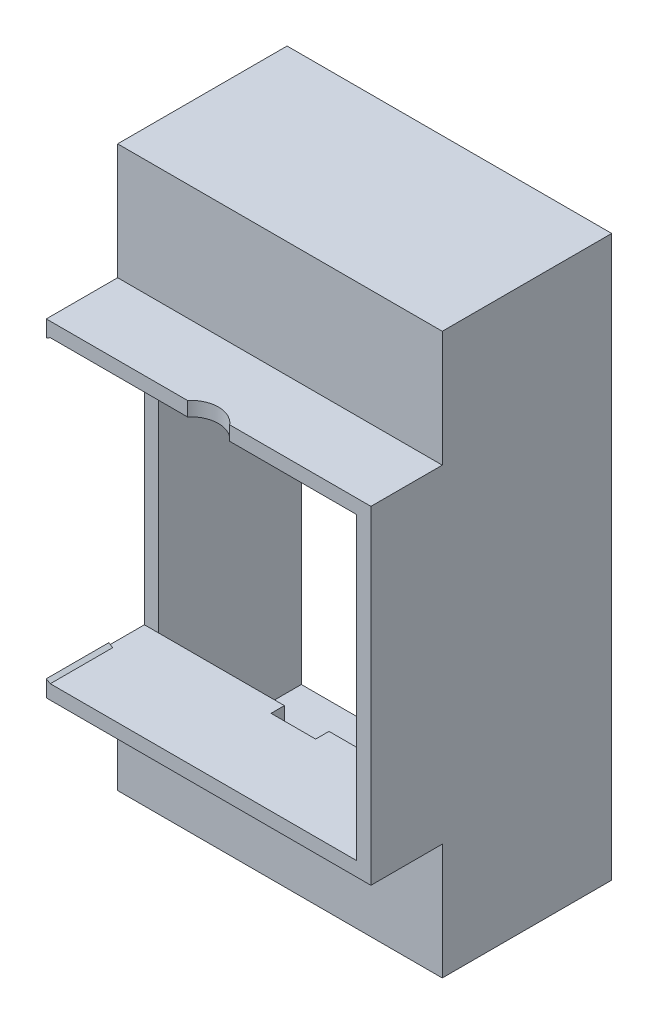
ISO-10303-21;
HEADER;
FILE_DESCRIPTION(('STEP AP214'),'2;1');
FILE_NAME('part.step','',(''),(''),'','','');
FILE_SCHEMA(('AUTOMOTIVE_DESIGN { 1 0 10303 214 1 1 1 1 }'));
ENDSEC;
DATA;
#1=APPLICATION_CONTEXT('core data for automotive mechanical design processes');
#2=APPLICATION_PROTOCOL_DEFINITION('international standard','automotive_design',2000,#1);
#3=PRODUCT_CONTEXT('',#1,'mechanical');
#4=PRODUCT('Part','Part','',(#3));
#5=PRODUCT_RELATED_PRODUCT_CATEGORY('part','',(#4));
#6=PRODUCT_DEFINITION_FORMATION('','',#4);
#7=PRODUCT_DEFINITION_CONTEXT('part definition',#1,'design');
#8=PRODUCT_DEFINITION('design','',#6,#7);
#9=PRODUCT_DEFINITION_SHAPE('','',#8);
#10=(LENGTH_UNIT() NAMED_UNIT(*) SI_UNIT(.MILLI.,.METRE.));
#11=(NAMED_UNIT(*) PLANE_ANGLE_UNIT() SI_UNIT($,.RADIAN.));
#12=(NAMED_UNIT(*) SI_UNIT($,.STERADIAN.) SOLID_ANGLE_UNIT());
#13=UNCERTAINTY_MEASURE_WITH_UNIT(LENGTH_MEASURE(1.E-05),#10,'distance_accuracy_value','');
#14=(GEOMETRIC_REPRESENTATION_CONTEXT(3) GLOBAL_UNCERTAINTY_ASSIGNED_CONTEXT((#13)) GLOBAL_UNIT_ASSIGNED_CONTEXT((#10,
#11,#12)) REPRESENTATION_CONTEXT('',''));
#15=CARTESIAN_POINT('',(0.,0.,0.));
#16=DIRECTION('',(0.,0.,1.));
#17=DIRECTION('',(1.,0.,0.));
#18=AXIS2_PLACEMENT_3D('',#15,#16,#17);
#19=CARTESIAN_POINT('',(30.25,31.4,-8.));
#20=DIRECTION('',(-1.,0.,0.));
#21=DIRECTION('',(0.,0.,1.));
#22=AXIS2_PLACEMENT_3D('',#19,#20,#21);
#23=PLANE('',#22);
#24=DIRECTION('',(0.,0.,-1.));
#25=VECTOR('',#24,1.);
#26=CARTESIAN_POINT('',(30.25,16.8,7.));
#27=LINE('',#26,#25);
#28=CARTESIAN_POINT('',(30.25,16.8,12.));
#29=VERTEX_POINT('',#28);
#30=CARTESIAN_POINT('',(30.25,16.8,8.));
#31=VERTEX_POINT('',#30);
#32=EDGE_CURVE('E116',#29,#31,#27,.T.);
#33=ORIENTED_EDGE('',*,*,#32,.F.);
#34=DIRECTION('',(0.,1.,0.));
#35=VECTOR('',#34,1.);
#36=CARTESIAN_POINT('',(30.25,0.,12.));
#37=LINE('',#36,#35);
#38=CARTESIAN_POINT('',(30.25,16.541085212282,12.));
#39=VERTEX_POINT('',#38);
#40=EDGE_CURVE('E119',#39,#29,#37,.T.);
#41=ORIENTED_EDGE('',*,*,#40,.F.);
#42=DIRECTION('',(0.,0.,-1.));
#43=VECTOR('',#42,1.);
#44=CARTESIAN_POINT('',(30.25,16.541085212282,12.));
#45=LINE('',#44,#43);
#46=CARTESIAN_POINT('',(30.25,16.541085212282,19.));
#47=VERTEX_POINT('',#46);
#48=EDGE_CURVE('E110',#47,#39,#45,.T.);
#49=ORIENTED_EDGE('',*,*,#48,.F.);
#50=DIRECTION('',(0.,1.,0.));
#51=VECTOR('',#50,1.);
#52=CARTESIAN_POINT('',(30.25,-10.9844410203712,19.));
#53=LINE('',#52,#51);
#54=CARTESIAN_POINT('',(30.25,18.4,19.));
#55=VERTEX_POINT('',#54);
#56=EDGE_CURVE('E129',#47,#55,#53,.T.);
#57=ORIENTED_EDGE('',*,*,#56,.T.);
#58=DIRECTION('',(0.,0.,1.));
#59=VECTOR('',#58,1.);
#60=CARTESIAN_POINT('',(30.25,18.4,7.));
#61=LINE('',#60,#59);
#62=CARTESIAN_POINT('',(30.25,18.4,11.));
#63=VERTEX_POINT('',#62);
#64=EDGE_CURVE('E113',#63,#55,#61,.T.);
#65=ORIENTED_EDGE('',*,*,#64,.F.);
#66=DIRECTION('',(0.,1.,0.));
#67=VECTOR('',#66,1.);
#68=CARTESIAN_POINT('',(30.25,18.4,11.));
#69=LINE('',#68,#67);
#70=CARTESIAN_POINT('',(30.25,31.4,11.));
#71=VERTEX_POINT('',#70);
#72=EDGE_CURVE('E210',#63,#71,#69,.T.);
#73=ORIENTED_EDGE('',*,*,#72,.T.);
#74=DIRECTION('',(0.,0.,-1.));
#75=VECTOR('',#74,1.);
#76=CARTESIAN_POINT('',(30.25,31.4,11.));
#77=LINE('',#76,#75);
#78=CARTESIAN_POINT('',(30.25,31.4,-8.));
#79=VERTEX_POINT('',#78);
#80=EDGE_CURVE('E195',#71,#79,#77,.T.);
#81=ORIENTED_EDGE('',*,*,#80,.T.);
#82=DIRECTION('',(0.,1.,0.));
#83=VECTOR('',#82,1.);
#84=CARTESIAN_POINT('',(30.25,31.4,-8.));
#85=LINE('',#84,#83);
#86=CARTESIAN_POINT('',(30.2499999999999,-31.4,-8.));
#87=VERTEX_POINT('',#86);
#88=EDGE_CURVE('E242',#87,#79,#85,.T.);
#89=ORIENTED_EDGE('',*,*,#88,.F.);
#90=DIRECTION('',(0.,0.,-1.));
#91=VECTOR('',#90,1.);
#92=CARTESIAN_POINT('',(30.2499999999999,-31.4,11.));
#93=LINE('',#92,#91);
#94=CARTESIAN_POINT('',(30.2499999999999,-31.4,11.));
#95=VERTEX_POINT('',#94);
#96=EDGE_CURVE('E213',#95,#87,#93,.T.);
#97=ORIENTED_EDGE('',*,*,#96,.F.);
#98=DIRECTION('',(0.,1.,0.));
#99=VECTOR('',#98,1.);
#100=CARTESIAN_POINT('',(30.2499999999999,-18.4,11.));
#101=LINE('',#100,#99);
#102=CARTESIAN_POINT('',(30.2499999999999,-18.4,11.));
#103=VERTEX_POINT('',#102);
#104=EDGE_CURVE('E228',#95,#103,#101,.T.);
#105=ORIENTED_EDGE('',*,*,#104,.T.);
#106=DIRECTION('',(0.,0.,-1.));
#107=VECTOR('',#106,1.);
#108=CARTESIAN_POINT('',(30.25,-18.4,7.));
#109=LINE('',#108,#107);
#110=CARTESIAN_POINT('',(30.25,-18.4,19.));
#111=VERTEX_POINT('',#110);
#112=EDGE_CURVE('E106',#111,#103,#109,.T.);
#113=ORIENTED_EDGE('',*,*,#112,.F.);
#114=CARTESIAN_POINT('',(30.25,-16.5410852122849,19.));
#115=VERTEX_POINT('',#114);
#116=EDGE_CURVE('E128',#111,#115,#53,.T.);
#117=ORIENTED_EDGE('',*,*,#116,.T.);
#118=DIRECTION('',(0.,0.,-1.));
#119=VECTOR('',#118,1.);
#120=CARTESIAN_POINT('',(30.25,-16.5410852122849,12.));
#121=LINE('',#120,#119);
#122=CARTESIAN_POINT('',(30.25,-16.5410852122849,12.));
#123=VERTEX_POINT('',#122);
#124=EDGE_CURVE('E132',#115,#123,#121,.T.);
#125=ORIENTED_EDGE('',*,*,#124,.T.);
#126=DIRECTION('',(0.,1.,0.));
#127=VECTOR('',#126,1.);
#128=CARTESIAN_POINT('',(30.25,0.,12.));
#129=LINE('',#128,#127);
#130=CARTESIAN_POINT('',(30.25,-16.8,12.));
#131=VERTEX_POINT('',#130);
#132=EDGE_CURVE('E125',#131,#123,#129,.T.);
#133=ORIENTED_EDGE('',*,*,#132,.F.);
#134=DIRECTION('',(0.,0.,1.));
#135=VECTOR('',#134,1.);
#136=CARTESIAN_POINT('',(30.25,-16.8,7.));
#137=LINE('',#136,#135);
#138=CARTESIAN_POINT('',(30.2499999999999,-16.7999999999999,8.));
#139=VERTEX_POINT('',#138);
#140=EDGE_CURVE('E122',#139,#131,#137,.T.);
#141=ORIENTED_EDGE('',*,*,#140,.F.);
#142=DIRECTION('',(0.,1.,0.));
#143=VECTOR('',#142,1.);
#144=CARTESIAN_POINT('',(30.25,31.4,8.));
#145=LINE('',#144,#143);
#146=EDGE_CURVE('E235',#139,#31,#145,.T.);
#147=ORIENTED_EDGE('',*,*,#146,.T.);
#148=EDGE_LOOP('',(#33,#41,#49,#57,#65,#73,#81,#89,#97,#105,#113,#117,#125,#133,#141,#147));
#149=FACE_BOUND('',#148,.T.);
#150=ADVANCED_FACE('F35',(#149),#23,.T.);
#151=CARTESIAN_POINT('',(27.25,-10.9844410203712,19.));
#152=DIRECTION('',(0.,0.,-1.));
#153=DIRECTION('',(-1.,0.,0.));
#154=AXIS2_PLACEMENT_3D('',#151,#152,#153);
#155=PLANE('',#154);
#156=ORIENTED_EDGE('',*,*,#116,.F.);
#157=DIRECTION('',(1.,0.,0.));
#158=VECTOR('',#157,1.);
#159=CARTESIAN_POINT('',(59.8500000000001,-18.4,19.));
#160=LINE('',#159,#158);
#161=CARTESIAN_POINT('',(66.6500000000001,-18.4,19.));
#162=VERTEX_POINT('',#161);
#163=EDGE_CURVE('E137',#111,#162,#160,.T.);
#164=ORIENTED_EDGE('',*,*,#163,.T.);
#165=DIRECTION('',(0.,1.,0.));
#166=VECTOR('',#165,1.);
#167=CARTESIAN_POINT('',(66.65,16.9,19.));
#168=LINE('',#167,#166);
#169=CARTESIAN_POINT('',(66.65,18.4,19.));
#170=VERTEX_POINT('',#169);
#171=EDGE_CURVE('E151',#162,#170,#168,.T.);
#172=ORIENTED_EDGE('',*,*,#171,.T.);
#173=DIRECTION('',(-1.,0.,0.));
#174=VECTOR('',#173,1.);
#175=CARTESIAN_POINT('',(29.75,18.4,19.));
#176=LINE('',#175,#174);
#177=CARTESIAN_POINT('',(50.8185438564654,18.4,19.));
#178=VERTEX_POINT('',#177);
#179=EDGE_CURVE('E143',#170,#178,#176,.T.);
#180=ORIENTED_EDGE('',*,*,#179,.T.);
#181=DIRECTION('',(0.,1.,0.));
#182=VECTOR('',#181,1.);
#183=CARTESIAN_POINT('',(50.8185438564654,-27.101,19.));
#184=LINE('',#183,#182);
#185=CARTESIAN_POINT('',(50.8185438564654,16.8,19.));
#186=VERTEX_POINT('',#185);
#187=EDGE_CURVE('E497',#186,#178,#184,.T.);
#188=ORIENTED_EDGE('',*,*,#187,.F.);
#189=DIRECTION('',(1.,0.,0.));
#190=VECTOR('',#189,1.);
#191=CARTESIAN_POINT('',(29.75,16.8,19.));
#192=LINE('',#191,#190);
#193=CARTESIAN_POINT('',(65.05,16.8,19.));
#194=VERTEX_POINT('',#193);
#195=EDGE_CURVE('E144',#186,#194,#192,.T.);
#196=ORIENTED_EDGE('',*,*,#195,.T.);
#197=DIRECTION('',(0.,-1.,0.));
#198=VECTOR('',#197,1.);
#199=CARTESIAN_POINT('',(65.05,15.3,19.));
#200=LINE('',#199,#198);
#201=CARTESIAN_POINT('',(65.0500000000001,-16.8,19.));
#202=VERTEX_POINT('',#201);
#203=EDGE_CURVE('E458',#194,#202,#200,.T.);
#204=ORIENTED_EDGE('',*,*,#203,.T.);
#205=DIRECTION('',(-1.,0.,0.));
#206=VECTOR('',#205,1.);
#207=CARTESIAN_POINT('',(29.75,-16.8,19.));
#208=LINE('',#207,#206);
#209=CARTESIAN_POINT('',(30.6984535671534,-16.8,19.));
#210=VERTEX_POINT('',#209);
#211=EDGE_CURVE('E148',#202,#210,#208,.T.);
#212=ORIENTED_EDGE('',*,*,#211,.T.);
#213=DIRECTION('',(0.866025403784439,-0.5,0.));
#214=VECTOR('',#213,1.);
#215=CARTESIAN_POINT('',(0.399999999999078,0.692820323025954,19.));
#216=LINE('',#215,#214);
#217=EDGE_CURVE('E152',#115,#210,#216,.T.);
#218=ORIENTED_EDGE('',*,*,#217,.F.);
#219=EDGE_LOOP('',(#156,#164,#172,#180,#188,#196,#204,#212,#218));
#220=FACE_BOUND('',#219,.T.);
#221=ADVANCED_FACE('F490',(#220),#155,.F.);
#222=ORIENTED_EDGE('',*,*,#56,.F.);
#223=DIRECTION('',(0.866025403784439,0.499999999999999,0.));
#224=VECTOR('',#223,1.);
#225=CARTESIAN_POINT('',(19.1061487217433,10.1071796769714,19.));
#226=LINE('',#225,#224);
#227=CARTESIAN_POINT('',(30.6984535671584,16.8,19.));
#228=VERTEX_POINT('',#227);
#229=EDGE_CURVE('E109',#47,#228,#226,.T.);
#230=ORIENTED_EDGE('',*,*,#229,.T.);
#231=CARTESIAN_POINT('',(46.0814561435346,16.8,19.));
#232=VERTEX_POINT('',#231);
#233=EDGE_CURVE('E147',#228,#232,#192,.T.);
#234=ORIENTED_EDGE('',*,*,#233,.T.);
#235=DIRECTION('',(0.,1.,0.));
#236=VECTOR('',#235,1.);
#237=CARTESIAN_POINT('',(46.0814561435346,-27.101,19.));
#238=LINE('',#237,#236);
#239=CARTESIAN_POINT('',(46.0814561435346,18.4,19.));
#240=VERTEX_POINT('',#239);
#241=EDGE_CURVE('E493',#240,#232,#238,.F.);
#242=ORIENTED_EDGE('',*,*,#241,.F.);
#243=EDGE_CURVE('E140',#240,#55,#176,.T.);
#244=ORIENTED_EDGE('',*,*,#243,.T.);
#245=EDGE_LOOP('',(#222,#230,#234,#242,#244));
#246=FACE_BOUND('',#245,.T.);
#247=ADVANCED_FACE('F509',(#246),#155,.F.);
#248=CARTESIAN_POINT('',(0.,0.,12.));
#249=DIRECTION('',(0.,0.,-1.));
#250=DIRECTION('',(-1.,0.,0.));
#251=AXIS2_PLACEMENT_3D('',#248,#249,#250);
#252=PLANE('',#251);
#253=DIRECTION('',(-1.,0.,0.));
#254=VECTOR('',#253,1.);
#255=CARTESIAN_POINT('',(29.75,-16.8,12.));
#256=LINE('',#255,#254);
#257=CARTESIAN_POINT('',(30.6984535671534,-16.8,12.));
#258=VERTEX_POINT('',#257);
#259=EDGE_CURVE('E164',#258,#131,#256,.T.);
#260=ORIENTED_EDGE('',*,*,#259,.T.);
#261=ORIENTED_EDGE('',*,*,#132,.T.);
#262=DIRECTION('',(-0.866025403784439,0.5,0.));
#263=VECTOR('',#262,1.);
#264=CARTESIAN_POINT('',(19.106148721742,-10.1071796769735,12.));
#265=LINE('',#264,#263);
#266=EDGE_CURVE('E39',#258,#123,#265,.T.);
#267=ORIENTED_EDGE('',*,*,#266,.F.);
#268=EDGE_LOOP('',(#260,#261,#267));
#269=FACE_BOUND('',#268,.T.);
#270=ADVANCED_FACE('F566',(#269),#252,.T.);
#271=CARTESIAN_POINT('',(29.75,-16.8,7.));
#272=DIRECTION('',(0.,1.,0.));
#273=DIRECTION('',(-1.,0.,0.));
#274=AXIS2_PLACEMENT_3D('',#271,#272,#273);
#275=PLANE('',#274);
#276=DIRECTION('',(-1.,0.,0.));
#277=VECTOR('',#276,1.);
#278=CARTESIAN_POINT('',(29.75,-16.8,8.));
#279=LINE('',#278,#277);
#280=CARTESIAN_POINT('',(31.8499999999999,-16.8,8.));
#281=VERTEX_POINT('',#280);
#282=EDGE_CURVE('E231',#281,#139,#279,.T.);
#283=ORIENTED_EDGE('',*,*,#282,.T.);
#284=ORIENTED_EDGE('',*,*,#140,.T.);
#285=ORIENTED_EDGE('',*,*,#259,.F.);
#286=DIRECTION('',(0.,0.,1.));
#287=VECTOR('',#286,1.);
#288=CARTESIAN_POINT('',(30.6984535671534,-16.8,7.));
#289=LINE('',#288,#287);
#290=EDGE_CURVE('E163',#258,#210,#289,.T.);
#291=ORIENTED_EDGE('',*,*,#290,.T.);
#292=ORIENTED_EDGE('',*,*,#211,.F.);
#293=DIRECTION('',(0.,0.,1.));
#294=VECTOR('',#293,1.);
#295=CARTESIAN_POINT('',(65.0500000000001,-16.8,7.));
#296=LINE('',#295,#294);
#297=CARTESIAN_POINT('',(65.0500000000001,-16.8,8.));
#298=VERTEX_POINT('',#297);
#299=EDGE_CURVE('E455',#298,#202,#296,.T.);
#300=ORIENTED_EDGE('',*,*,#299,.F.);
#301=DIRECTION('',(-1.,0.,0.));
#302=VECTOR('',#301,1.);
#303=CARTESIAN_POINT('',(29.75,-16.8,8.));
#304=LINE('',#303,#302);
#305=CARTESIAN_POINT('',(50.95,-16.8,8.));
#306=VERTEX_POINT('',#305);
#307=EDGE_CURVE('E186',#298,#306,#304,.T.);
#308=ORIENTED_EDGE('',*,*,#307,.T.);
#309=DIRECTION('',(0.,0.,-1.));
#310=VECTOR('',#309,1.);
#311=CARTESIAN_POINT('',(50.95,-16.7999999999999,7.));
#312=LINE('',#311,#310);
#313=CARTESIAN_POINT('',(50.95,-16.7999999999999,9.5));
#314=VERTEX_POINT('',#313);
#315=EDGE_CURVE('E290',#314,#306,#312,.T.);
#316=ORIENTED_EDGE('',*,*,#315,.F.);
#317=DIRECTION('',(-1.,0.,0.));
#318=VECTOR('',#317,1.);
#319=CARTESIAN_POINT('',(29.75,-16.8,9.5));
#320=LINE('',#319,#318);
#321=CARTESIAN_POINT('',(45.95,-16.7999999999999,9.5));
#322=VERTEX_POINT('',#321);
#323=EDGE_CURVE('E82',#314,#322,#320,.T.);
#324=ORIENTED_EDGE('',*,*,#323,.T.);
#325=DIRECTION('',(0.,0.,1.));
#326=VECTOR('',#325,1.);
#327=CARTESIAN_POINT('',(45.95,-16.7999999999999,7.));
#328=LINE('',#327,#326);
#329=CARTESIAN_POINT('',(45.95,-16.8,8.));
#330=VERTEX_POINT('',#329);
#331=EDGE_CURVE('E295',#330,#322,#328,.T.);
#332=ORIENTED_EDGE('',*,*,#331,.F.);
#333=EDGE_CURVE('E189',#330,#281,#304,.T.);
#334=ORIENTED_EDGE('',*,*,#333,.T.);
#335=EDGE_LOOP('',(#283,#284,#285,#291,#292,#300,#308,#316,#324,#332,#334));
#336=FACE_BOUND('',#335,.T.);
#337=ADVANCED_FACE('F37',(#336),#275,.T.);
#338=CARTESIAN_POINT('',(19.106148721742,-10.1071796769735,12.));
#339=DIRECTION('',(-0.5,-0.866025403784439,0.));
#340=DIRECTION('',(0.866025403784439,-0.5,0.));
#341=AXIS2_PLACEMENT_3D('',#338,#339,#340);
#342=PLANE('',#341);
#343=ORIENTED_EDGE('',*,*,#124,.F.);
#344=ORIENTED_EDGE('',*,*,#217,.T.);
#345=ORIENTED_EDGE('',*,*,#290,.F.);
#346=ORIENTED_EDGE('',*,*,#266,.T.);
#347=EDGE_LOOP('',(#343,#344,#345,#346));
#348=FACE_BOUND('',#347,.T.);
#349=ADVANCED_FACE('F568',(#348),#342,.F.);
#350=DIRECTION('',(0.866025403784439,0.499999999999999,0.));
#351=VECTOR('',#350,1.);
#352=CARTESIAN_POINT('',(19.1061487217433,10.1071796769714,12.));
#353=LINE('',#352,#351);
#354=CARTESIAN_POINT('',(30.6984535671584,16.8,12.));
#355=VERTEX_POINT('',#354);
#356=EDGE_CURVE('E160',#39,#355,#353,.T.);
#357=ORIENTED_EDGE('',*,*,#356,.F.);
#358=ORIENTED_EDGE('',*,*,#40,.T.);
#359=DIRECTION('',(1.,0.,0.));
#360=VECTOR('',#359,1.);
#361=CARTESIAN_POINT('',(29.75,16.8,12.));
#362=LINE('',#361,#360);
#363=EDGE_CURVE('E157',#29,#355,#362,.T.);
#364=ORIENTED_EDGE('',*,*,#363,.T.);
#365=EDGE_LOOP('',(#357,#358,#364));
#366=FACE_BOUND('',#365,.T.);
#367=ADVANCED_FACE('F570',(#366),#252,.T.);
#368=CARTESIAN_POINT('',(29.75,16.8,7.));
#369=DIRECTION('',(0.,-1.,0.));
#370=DIRECTION('',(1.,0.,0.));
#371=AXIS2_PLACEMENT_3D('',#368,#369,#370);
#372=PLANE('',#371);
#373=ORIENTED_EDGE('',*,*,#363,.F.);
#374=ORIENTED_EDGE('',*,*,#32,.T.);
#375=DIRECTION('',(1.,0.,0.));
#376=VECTOR('',#375,1.);
#377=CARTESIAN_POINT('',(29.75,16.8,8.));
#378=LINE('',#377,#376);
#379=CARTESIAN_POINT('',(31.8499999999999,16.8,8.));
#380=VERTEX_POINT('',#379);
#381=EDGE_CURVE('E190',#31,#380,#378,.T.);
#382=ORIENTED_EDGE('',*,*,#381,.T.);
#383=CARTESIAN_POINT('',(45.95,16.8,8.));
#384=VERTEX_POINT('',#383);
#385=EDGE_CURVE('E193',#380,#384,#378,.T.);
#386=ORIENTED_EDGE('',*,*,#385,.T.);
#387=DIRECTION('',(0.,0.,-1.));
#388=VECTOR('',#387,1.);
#389=CARTESIAN_POINT('',(45.95,16.8,7.));
#390=LINE('',#389,#388);
#391=CARTESIAN_POINT('',(45.95,16.8,9.5));
#392=VERTEX_POINT('',#391);
#393=EDGE_CURVE('E298',#392,#384,#390,.T.);
#394=ORIENTED_EDGE('',*,*,#393,.F.);
#395=DIRECTION('',(1.,0.,0.));
#396=VECTOR('',#395,1.);
#397=CARTESIAN_POINT('',(29.75,16.8,9.5));
#398=LINE('',#397,#396);
#399=CARTESIAN_POINT('',(50.95,16.8,9.5));
#400=VERTEX_POINT('',#399);
#401=EDGE_CURVE('E156',#392,#400,#398,.T.);
#402=ORIENTED_EDGE('',*,*,#401,.T.);
#403=DIRECTION('',(0.,0.,1.));
#404=VECTOR('',#403,1.);
#405=CARTESIAN_POINT('',(50.95,16.8,7.));
#406=LINE('',#405,#404);
#407=CARTESIAN_POINT('',(50.95,16.8,8.));
#408=VERTEX_POINT('',#407);
#409=EDGE_CURVE('E292',#408,#400,#406,.T.);
#410=ORIENTED_EDGE('',*,*,#409,.F.);
#411=CARTESIAN_POINT('',(65.05,16.8,8.));
#412=VERTEX_POINT('',#411);
#413=EDGE_CURVE('E194',#408,#412,#378,.T.);
#414=ORIENTED_EDGE('',*,*,#413,.T.);
#415=DIRECTION('',(0.,0.,1.));
#416=VECTOR('',#415,1.);
#417=CARTESIAN_POINT('',(65.05,16.8,7.));
#418=LINE('',#417,#416);
#419=EDGE_CURVE('E446',#412,#194,#418,.T.);
#420=ORIENTED_EDGE('',*,*,#419,.T.);
#421=ORIENTED_EDGE('',*,*,#195,.F.);
#422=CARTESIAN_POINT('',(48.45,16.8,21.));
#423=DIRECTION('',(0.,-1.,0.));
#424=DIRECTION('',(1.,0.,0.));
#425=AXIS2_PLACEMENT_3D('',#422,#423,#424);
#426=CIRCLE('',#425,3.1);
#427=EDGE_CURVE('E183',#186,#232,#426,.F.);
#428=ORIENTED_EDGE('',*,*,#427,.T.);
#429=ORIENTED_EDGE('',*,*,#233,.F.);
#430=DIRECTION('',(0.,0.,1.));
#431=VECTOR('',#430,1.);
#432=CARTESIAN_POINT('',(30.6984535671584,16.8,7.));
#433=LINE('',#432,#431);
#434=EDGE_CURVE('E161',#355,#228,#433,.T.);
#435=ORIENTED_EDGE('',*,*,#434,.F.);
#436=EDGE_LOOP('',(#373,#374,#382,#386,#394,#402,#410,#414,#420,#421,#428,#429,#435));
#437=FACE_BOUND('',#436,.T.);
#438=ADVANCED_FACE('F416',(#437),#372,.T.);
#439=CARTESIAN_POINT('',(29.75,18.4,7.));
#440=DIRECTION('',(0.,1.,0.));
#441=DIRECTION('',(-1.,0.,0.));
#442=AXIS2_PLACEMENT_3D('',#439,#440,#441);
#443=PLANE('',#442);
#444=DIRECTION('',(-1.,0.,0.));
#445=VECTOR('',#444,1.);
#446=CARTESIAN_POINT('',(30.25,18.4,11.));
#447=LINE('',#446,#445);
#448=CARTESIAN_POINT('',(66.65,18.4,11.));
#449=VERTEX_POINT('',#448);
#450=EDGE_CURVE('E198',#449,#63,#447,.T.);
#451=ORIENTED_EDGE('',*,*,#450,.T.);
#452=ORIENTED_EDGE('',*,*,#64,.T.);
#453=ORIENTED_EDGE('',*,*,#243,.F.);
#454=CARTESIAN_POINT('',(48.45,18.4,21.));
#455=DIRECTION('',(0.,1.,0.));
#456=DIRECTION('',(-1.,0.,0.));
#457=AXIS2_PLACEMENT_3D('',#454,#455,#456);
#458=CIRCLE('',#457,3.1);
#459=EDGE_CURVE('E171',#178,#240,#458,.T.);
#460=ORIENTED_EDGE('',*,*,#459,.F.);
#461=ORIENTED_EDGE('',*,*,#179,.F.);
#462=DIRECTION('',(0.,0.,1.));
#463=VECTOR('',#462,1.);
#464=CARTESIAN_POINT('',(66.65,18.4,7.));
#465=LINE('',#464,#463);
#466=EDGE_CURVE('E155',#449,#170,#465,.T.);
#467=ORIENTED_EDGE('',*,*,#466,.F.);
#468=EDGE_LOOP('',(#451,#452,#453,#460,#461,#467));
#469=FACE_BOUND('',#468,.T.);
#470=ADVANCED_FACE('F480',(#469),#443,.T.);
#471=CARTESIAN_POINT('',(19.1061487217433,10.1071796769714,12.));
#472=DIRECTION('',(0.499999999999999,-0.866025403784439,0.));
#473=DIRECTION('',(0.866025403784439,0.499999999999999,0.));
#474=AXIS2_PLACEMENT_3D('',#471,#472,#473);
#475=PLANE('',#474);
#476=ORIENTED_EDGE('',*,*,#229,.F.);
#477=ORIENTED_EDGE('',*,*,#48,.T.);
#478=ORIENTED_EDGE('',*,*,#356,.T.);
#479=ORIENTED_EDGE('',*,*,#434,.T.);
#480=EDGE_LOOP('',(#476,#477,#478,#479));
#481=FACE_BOUND('',#480,.T.);
#482=ADVANCED_FACE('F589',(#481),#475,.T.);
#483=CARTESIAN_POINT('',(59.8500000000001,-18.4,7.));
#484=DIRECTION('',(0.,-1.,0.));
#485=DIRECTION('',(1.,0.,0.));
#486=AXIS2_PLACEMENT_3D('',#483,#484,#485);
#487=PLANE('',#486);
#488=ORIENTED_EDGE('',*,*,#163,.F.);
#489=ORIENTED_EDGE('',*,*,#112,.T.);
#490=DIRECTION('',(1.,0.,0.));
#491=VECTOR('',#490,1.);
#492=CARTESIAN_POINT('',(30.2499999999999,-18.4,11.));
#493=LINE('',#492,#491);
#494=CARTESIAN_POINT('',(66.6500000000001,-18.4,11.));
#495=VERTEX_POINT('',#494);
#496=EDGE_CURVE('E225',#103,#495,#493,.T.);
#497=ORIENTED_EDGE('',*,*,#496,.T.);
#498=DIRECTION('',(0.,0.,1.));
#499=VECTOR('',#498,1.);
#500=CARTESIAN_POINT('',(66.6500000000001,-18.4,7.));
#501=LINE('',#500,#499);
#502=EDGE_CURVE('E460',#495,#162,#501,.T.);
#503=ORIENTED_EDGE('',*,*,#502,.T.);
#504=EDGE_LOOP('',(#488,#489,#497,#503));
#505=FACE_BOUND('',#504,.T.);
#506=ADVANCED_FACE('F543',(#505),#487,.T.);
#507=CARTESIAN_POINT('',(31.85,29.8,-8.));
#508=DIRECTION('',(1.,0.,0.));
#509=DIRECTION('',(0.,1.,0.));
#510=AXIS2_PLACEMENT_3D('',#507,#508,#509);
#511=PLANE('',#510);
#512=DIRECTION('',(0.,1.,0.));
#513=VECTOR('',#512,1.);
#514=CARTESIAN_POINT('',(31.85,29.8,8.));
#515=LINE('',#514,#513);
#516=CARTESIAN_POINT('',(31.8499999999999,-29.8,8.));
#517=VERTEX_POINT('',#516);
#518=EDGE_CURVE('E262',#517,#281,#515,.T.);
#519=ORIENTED_EDGE('',*,*,#518,.F.);
#520=DIRECTION('',(0.,0.,1.));
#521=VECTOR('',#520,1.);
#522=CARTESIAN_POINT('',(31.8499999999999,-29.8,-8.));
#523=LINE('',#522,#521);
#524=CARTESIAN_POINT('',(31.8499999999999,-29.8,-8.));
#525=VERTEX_POINT('',#524);
#526=EDGE_CURVE('E255',#525,#517,#523,.T.);
#527=ORIENTED_EDGE('',*,*,#526,.F.);
#528=DIRECTION('',(0.,1.,0.));
#529=VECTOR('',#528,1.);
#530=CARTESIAN_POINT('',(31.85,29.8,-8.));
#531=LINE('',#530,#529);
#532=CARTESIAN_POINT('',(31.85,29.8,-8.));
#533=VERTEX_POINT('',#532);
#534=EDGE_CURVE('E261',#525,#533,#531,.T.);
#535=ORIENTED_EDGE('',*,*,#534,.T.);
#536=DIRECTION('',(0.,0.,1.));
#537=VECTOR('',#536,1.);
#538=CARTESIAN_POINT('',(31.85,29.8,-8.));
#539=LINE('',#538,#537);
#540=CARTESIAN_POINT('',(31.85,29.8,8.));
#541=VERTEX_POINT('',#540);
#542=EDGE_CURVE('E258',#533,#541,#539,.T.);
#543=ORIENTED_EDGE('',*,*,#542,.T.);
#544=EDGE_CURVE('E267',#380,#541,#515,.T.);
#545=ORIENTED_EDGE('',*,*,#544,.F.);
#546=EDGE_CURVE('E265',#281,#380,#515,.T.);
#547=ORIENTED_EDGE('',*,*,#546,.F.);
#548=EDGE_LOOP('',(#519,#527,#535,#543,#545,#547));
#549=FACE_BOUND('',#548,.T.);
#550=ADVANCED_FACE('F585',(#549),#511,.T.);
#551=CARTESIAN_POINT('',(65.05,-29.8,-8.));
#552=DIRECTION('',(0.,1.,0.));
#553=DIRECTION('',(0.,0.,1.));
#554=AXIS2_PLACEMENT_3D('',#551,#552,#553);
#555=PLANE('',#554);
#556=DIRECTION('',(-1.,0.,0.));
#557=VECTOR('',#556,1.);
#558=CARTESIAN_POINT('',(65.05,-29.8,8.));
#559=LINE('',#558,#557);
#560=CARTESIAN_POINT('',(65.05,-29.8,8.));
#561=VERTEX_POINT('',#560);
#562=CARTESIAN_POINT('',(50.95,-29.8,8.));
#563=VERTEX_POINT('',#562);
#564=EDGE_CURVE('E268',#561,#563,#559,.T.);
#565=ORIENTED_EDGE('',*,*,#564,.F.);
#566=DIRECTION('',(0.,0.,1.));
#567=VECTOR('',#566,1.);
#568=CARTESIAN_POINT('',(65.05,-29.8,-8.));
#569=LINE('',#568,#567);
#570=CARTESIAN_POINT('',(65.05,-29.8,-8.));
#571=VERTEX_POINT('',#570);
#572=EDGE_CURVE('E252',#571,#561,#569,.T.);
#573=ORIENTED_EDGE('',*,*,#572,.F.);
#574=DIRECTION('',(-1.,0.,0.));
#575=VECTOR('',#574,1.);
#576=CARTESIAN_POINT('',(65.05,-29.8,-8.));
#577=LINE('',#576,#575);
#578=EDGE_CURVE('E281',#571,#525,#577,.T.);
#579=ORIENTED_EDGE('',*,*,#578,.T.);
#580=ORIENTED_EDGE('',*,*,#526,.T.);
#581=CARTESIAN_POINT('',(45.95,-29.8,8.));
#582=VERTEX_POINT('',#581);
#583=EDGE_CURVE('E270',#582,#517,#559,.T.);
#584=ORIENTED_EDGE('',*,*,#583,.F.);
#585=DIRECTION('',(0.,0.,-1.));
#586=VECTOR('',#585,1.);
#587=CARTESIAN_POINT('',(45.95,-29.8,9.5));
#588=LINE('',#587,#586);
#589=CARTESIAN_POINT('',(45.95,-29.8,9.5));
#590=VERTEX_POINT('',#589);
#591=EDGE_CURVE('E54',#590,#582,#588,.T.);
#592=ORIENTED_EDGE('',*,*,#591,.F.);
#593=DIRECTION('',(-1.,0.,0.));
#594=VECTOR('',#593,1.);
#595=CARTESIAN_POINT('',(50.95,-29.8,9.5));
#596=LINE('',#595,#594);
#597=CARTESIAN_POINT('',(50.95,-29.8,9.5));
#598=VERTEX_POINT('',#597);
#599=EDGE_CURVE('E79',#598,#590,#596,.T.);
#600=ORIENTED_EDGE('',*,*,#599,.F.);
#601=DIRECTION('',(0.,0.,-1.));
#602=VECTOR('',#601,1.);
#603=CARTESIAN_POINT('',(50.95,-29.8,9.5));
#604=LINE('',#603,#602);
#605=EDGE_CURVE('E90',#598,#563,#604,.T.);
#606=ORIENTED_EDGE('',*,*,#605,.T.);
#607=EDGE_LOOP('',(#565,#573,#579,#580,#584,#592,#600,#606));
#608=FACE_BOUND('',#607,.T.);
#609=ADVANCED_FACE('F98',(#608),#555,.T.);
#610=CARTESIAN_POINT('',(65.05,29.8,-8.));
#611=DIRECTION('',(0.,-1.,0.));
#612=DIRECTION('',(0.,0.,-1.));
#613=AXIS2_PLACEMENT_3D('',#610,#611,#612);
#614=PLANE('',#613);
#615=DIRECTION('',(1.,0.,0.));
#616=VECTOR('',#615,1.);
#617=CARTESIAN_POINT('',(65.05,29.8,8.));
#618=LINE('',#617,#616);
#619=CARTESIAN_POINT('',(45.95,29.8,8.));
#620=VERTEX_POINT('',#619);
#621=EDGE_CURVE('E275',#541,#620,#618,.T.);
#622=ORIENTED_EDGE('',*,*,#621,.F.);
#623=ORIENTED_EDGE('',*,*,#542,.F.);
#624=DIRECTION('',(1.,0.,0.));
#625=VECTOR('',#624,1.);
#626=CARTESIAN_POINT('',(65.05,29.8,-8.));
#627=LINE('',#626,#625);
#628=CARTESIAN_POINT('',(65.05,29.8,-8.));
#629=VERTEX_POINT('',#628);
#630=EDGE_CURVE('E266',#533,#629,#627,.T.);
#631=ORIENTED_EDGE('',*,*,#630,.T.);
#632=DIRECTION('',(0.,0.,1.));
#633=VECTOR('',#632,1.);
#634=CARTESIAN_POINT('',(65.05,29.8,-8.));
#635=LINE('',#634,#633);
#636=CARTESIAN_POINT('',(65.05,29.8,8.));
#637=VERTEX_POINT('',#636);
#638=EDGE_CURVE('E238',#629,#637,#635,.T.);
#639=ORIENTED_EDGE('',*,*,#638,.T.);
#640=CARTESIAN_POINT('',(50.95,29.8,8.));
#641=VERTEX_POINT('',#640);
#642=EDGE_CURVE('E278',#641,#637,#618,.T.);
#643=ORIENTED_EDGE('',*,*,#642,.F.);
#644=DIRECTION('',(0.,0.,-1.));
#645=VECTOR('',#644,1.);
#646=CARTESIAN_POINT('',(50.95,29.8,9.5));
#647=LINE('',#646,#645);
#648=CARTESIAN_POINT('',(50.95,29.8,9.5));
#649=VERTEX_POINT('',#648);
#650=EDGE_CURVE('E300',#649,#641,#647,.T.);
#651=ORIENTED_EDGE('',*,*,#650,.F.);
#652=DIRECTION('',(1.,0.,0.));
#653=VECTOR('',#652,1.);
#654=CARTESIAN_POINT('',(50.95,29.8,9.5));
#655=LINE('',#654,#653);
#656=CARTESIAN_POINT('',(45.95,29.8,9.5));
#657=VERTEX_POINT('',#656);
#658=EDGE_CURVE('E96',#657,#649,#655,.T.);
#659=ORIENTED_EDGE('',*,*,#658,.F.);
#660=DIRECTION('',(0.,0.,-1.));
#661=VECTOR('',#660,1.);
#662=CARTESIAN_POINT('',(45.95,29.8,9.5));
#663=LINE('',#662,#661);
#664=EDGE_CURVE('E303',#657,#620,#663,.T.);
#665=ORIENTED_EDGE('',*,*,#664,.T.);
#666=EDGE_LOOP('',(#622,#623,#631,#639,#643,#651,#659,#665));
#667=FACE_BOUND('',#666,.T.);
#668=ADVANCED_FACE('F447',(#667),#614,.T.);
#669=CARTESIAN_POINT('',(30.25,31.4,11.));
#670=DIRECTION('',(0.,1.,0.));
#671=DIRECTION('',(-1.,0.,0.));
#672=AXIS2_PLACEMENT_3D('',#669,#670,#671);
#673=PLANE('',#672);
#674=DIRECTION('',(0.,0.,-1.));
#675=VECTOR('',#674,1.);
#676=CARTESIAN_POINT('',(66.65,31.4,11.));
#677=LINE('',#676,#675);
#678=CARTESIAN_POINT('',(66.65,31.4,11.));
#679=VERTEX_POINT('',#678);
#680=CARTESIAN_POINT('',(66.65,31.4,-8.));
#681=VERTEX_POINT('',#680);
#682=EDGE_CURVE('E199',#679,#681,#677,.T.);
#683=ORIENTED_EDGE('',*,*,#682,.T.);
#684=DIRECTION('',(1.,0.,0.));
#685=VECTOR('',#684,1.);
#686=CARTESIAN_POINT('',(66.65,31.4,-8.));
#687=LINE('',#686,#685);
#688=EDGE_CURVE('E234',#79,#681,#687,.T.);
#689=ORIENTED_EDGE('',*,*,#688,.F.);
#690=ORIENTED_EDGE('',*,*,#80,.F.);
#691=DIRECTION('',(1.,0.,0.));
#692=VECTOR('',#691,1.);
#693=CARTESIAN_POINT('',(30.25,31.4,11.));
#694=LINE('',#693,#692);
#695=EDGE_CURVE('E207',#71,#679,#694,.T.);
#696=ORIENTED_EDGE('',*,*,#695,.T.);
#697=EDGE_LOOP('',(#683,#689,#690,#696));
#698=FACE_BOUND('',#697,.T.);
#699=ADVANCED_FACE('F558',(#698),#673,.T.);
#700=CARTESIAN_POINT('',(0.,0.,-8.));
#701=DIRECTION('',(0.,0.,-1.));
#702=DIRECTION('',(-1.,0.,0.));
#703=AXIS2_PLACEMENT_3D('',#700,#701,#702);
#704=PLANE('',#703);
#705=DIRECTION('',(0.,-1.,0.));
#706=VECTOR('',#705,1.);
#707=CARTESIAN_POINT('',(66.65,31.4,-8.));
#708=LINE('',#707,#706);
#709=CARTESIAN_POINT('',(66.65,-31.4,-8.));
#710=VERTEX_POINT('',#709);
#711=EDGE_CURVE('E239',#681,#710,#708,.T.);
#712=ORIENTED_EDGE('',*,*,#711,.T.);
#713=DIRECTION('',(-1.,0.,0.));
#714=VECTOR('',#713,1.);
#715=CARTESIAN_POINT('',(66.65,-31.4,-8.));
#716=LINE('',#715,#714);
#717=EDGE_CURVE('E245',#710,#87,#716,.T.);
#718=ORIENTED_EDGE('',*,*,#717,.T.);
#719=ORIENTED_EDGE('',*,*,#88,.T.);
#720=ORIENTED_EDGE('',*,*,#688,.T.);
#721=EDGE_LOOP('',(#712,#718,#719,#720));
#722=FACE_BOUND('',#721,.T.);
#723=DIRECTION('',(0.,-1.,0.));
#724=VECTOR('',#723,1.);
#725=CARTESIAN_POINT('',(65.05,29.8,-8.));
#726=LINE('',#725,#724);
#727=EDGE_CURVE('E284',#629,#571,#726,.T.);
#728=ORIENTED_EDGE('',*,*,#727,.F.);
#729=ORIENTED_EDGE('',*,*,#630,.F.);
#730=ORIENTED_EDGE('',*,*,#534,.F.);
#731=ORIENTED_EDGE('',*,*,#578,.F.);
#732=EDGE_LOOP('',(#728,#729,#730,#731));
#733=FACE_BOUND('',#732,.T.);
#734=ADVANCED_FACE('F452',(#722,#733),#704,.T.);
#735=CARTESIAN_POINT('',(30.2499999999999,-31.4,11.));
#736=DIRECTION('',(0.,-1.,0.));
#737=DIRECTION('',(1.,0.,0.));
#738=AXIS2_PLACEMENT_3D('',#735,#736,#737);
#739=PLANE('',#738);
#740=ORIENTED_EDGE('',*,*,#96,.T.);
#741=ORIENTED_EDGE('',*,*,#717,.F.);
#742=DIRECTION('',(0.,0.,-1.));
#743=VECTOR('',#742,1.);
#744=CARTESIAN_POINT('',(66.6500000000001,-31.4,11.));
#745=LINE('',#744,#743);
#746=CARTESIAN_POINT('',(66.6500000000001,-31.4,11.));
#747=VERTEX_POINT('',#746);
#748=EDGE_CURVE('E214',#747,#710,#745,.T.);
#749=ORIENTED_EDGE('',*,*,#748,.F.);
#750=DIRECTION('',(-1.,0.,0.));
#751=VECTOR('',#750,1.);
#752=CARTESIAN_POINT('',(30.2499999999999,-31.4,11.));
#753=LINE('',#752,#751);
#754=EDGE_CURVE('E217',#747,#95,#753,.T.);
#755=ORIENTED_EDGE('',*,*,#754,.T.);
#756=EDGE_LOOP('',(#740,#741,#749,#755));
#757=FACE_BOUND('',#756,.T.);
#758=ADVANCED_FACE('F550',(#757),#739,.T.);
#759=CARTESIAN_POINT('',(0.,0.,8.));
#760=DIRECTION('',(0.,0.,-1.));
#761=DIRECTION('',(-1.,0.,0.));
#762=AXIS2_PLACEMENT_3D('',#759,#760,#761);
#763=PLANE('',#762);
#764=DIRECTION('',(0.,-1.,0.));
#765=VECTOR('',#764,1.);
#766=CARTESIAN_POINT('',(50.95,29.8,8.));
#767=LINE('',#766,#765);
#768=EDGE_CURVE('E45',#641,#408,#767,.T.);
#769=ORIENTED_EDGE('',*,*,#768,.F.);
#770=ORIENTED_EDGE('',*,*,#642,.T.);
#771=DIRECTION('',(0.,-1.,0.));
#772=VECTOR('',#771,1.);
#773=CARTESIAN_POINT('',(65.05,29.8,8.));
#774=LINE('',#773,#772);
#775=EDGE_CURVE('E271',#637,#412,#774,.T.);
#776=ORIENTED_EDGE('',*,*,#775,.T.);
#777=ORIENTED_EDGE('',*,*,#413,.F.);
#778=EDGE_LOOP('',(#769,#770,#776,#777));
#779=FACE_BOUND('',#778,.T.);
#780=ADVANCED_FACE('F419',(#779),#763,.T.);
#781=CARTESIAN_POINT('',(50.95,29.8,9.5));
#782=DIRECTION('',(1.,0.,0.));
#783=DIRECTION('',(0.,1.,0.));
#784=AXIS2_PLACEMENT_3D('',#781,#782,#783);
#785=PLANE('',#784);
#786=ORIENTED_EDGE('',*,*,#409,.T.);
#787=DIRECTION('',(0.,-1.,0.));
#788=VECTOR('',#787,1.);
#789=CARTESIAN_POINT('',(50.95,29.8,9.5));
#790=LINE('',#789,#788);
#791=EDGE_CURVE('E87',#649,#400,#790,.T.);
#792=ORIENTED_EDGE('',*,*,#791,.F.);
#793=ORIENTED_EDGE('',*,*,#650,.T.);
#794=ORIENTED_EDGE('',*,*,#768,.T.);
#795=EDGE_LOOP('',(#786,#792,#793,#794));
#796=FACE_BOUND('',#795,.T.);
#797=ADVANCED_FACE('F407',(#796),#785,.F.);
#798=CARTESIAN_POINT('',(0.,0.,9.5));
#799=DIRECTION('',(0.,0.,-1.));
#800=DIRECTION('',(-1.,0.,0.));
#801=AXIS2_PLACEMENT_3D('',#798,#799,#800);
#802=PLANE('',#801);
#803=DIRECTION('',(0.,1.,0.));
#804=VECTOR('',#803,1.);
#805=CARTESIAN_POINT('',(45.95,29.8,9.5));
#806=LINE('',#805,#804);
#807=EDGE_CURVE('E99',#392,#657,#806,.T.);
#808=ORIENTED_EDGE('',*,*,#807,.T.);
#809=ORIENTED_EDGE('',*,*,#658,.T.);
#810=ORIENTED_EDGE('',*,*,#791,.T.);
#811=ORIENTED_EDGE('',*,*,#401,.F.);
#812=EDGE_LOOP('',(#808,#809,#810,#811));
#813=FACE_BOUND('',#812,.T.);
#814=ADVANCED_FACE('F661',(#813),#802,.T.);
#815=CARTESIAN_POINT('',(45.95,29.8,9.5));
#816=DIRECTION('',(-1.,0.,0.));
#817=DIRECTION('',(0.,-1.,0.));
#818=AXIS2_PLACEMENT_3D('',#815,#816,#817);
#819=PLANE('',#818);
#820=ORIENTED_EDGE('',*,*,#393,.T.);
#821=DIRECTION('',(0.,1.,0.));
#822=VECTOR('',#821,1.);
#823=CARTESIAN_POINT('',(45.95,29.8,8.));
#824=LINE('',#823,#822);
#825=EDGE_CURVE('E307',#384,#620,#824,.T.);
#826=ORIENTED_EDGE('',*,*,#825,.T.);
#827=ORIENTED_EDGE('',*,*,#664,.F.);
#828=ORIENTED_EDGE('',*,*,#807,.F.);
#829=EDGE_LOOP('',(#820,#826,#827,#828));
#830=FACE_BOUND('',#829,.T.);
#831=ADVANCED_FACE('F432',(#830),#819,.F.);
#832=ORIENTED_EDGE('',*,*,#825,.F.);
#833=ORIENTED_EDGE('',*,*,#385,.F.);
#834=ORIENTED_EDGE('',*,*,#544,.T.);
#835=ORIENTED_EDGE('',*,*,#621,.T.);
#836=EDGE_LOOP('',(#832,#833,#834,#835));
#837=FACE_BOUND('',#836,.T.);
#838=ADVANCED_FACE('F427',(#837),#763,.T.);
#839=CARTESIAN_POINT('',(0.,0.,11.));
#840=DIRECTION('',(0.,0.,-1.));
#841=DIRECTION('',(-1.,0.,0.));
#842=AXIS2_PLACEMENT_3D('',#839,#840,#841);
#843=PLANE('',#842);
#844=ORIENTED_EDGE('',*,*,#72,.F.);
#845=ORIENTED_EDGE('',*,*,#450,.F.);
#846=DIRECTION('',(0.,-1.,0.));
#847=VECTOR('',#846,1.);
#848=CARTESIAN_POINT('',(66.65,18.4,11.));
#849=LINE('',#848,#847);
#850=EDGE_CURVE('E204',#679,#449,#849,.T.);
#851=ORIENTED_EDGE('',*,*,#850,.F.);
#852=ORIENTED_EDGE('',*,*,#695,.F.);
#853=EDGE_LOOP('',(#844,#845,#851,#852));
#854=FACE_BOUND('',#853,.T.);
#855=ADVANCED_FACE('F557',(#854),#843,.F.);
#856=CARTESIAN_POINT('',(66.65,16.9,7.));
#857=DIRECTION('',(1.,0.,0.));
#858=DIRECTION('',(0.,1.,0.));
#859=AXIS2_PLACEMENT_3D('',#856,#857,#858);
#860=PLANE('',#859);
#861=ORIENTED_EDGE('',*,*,#171,.F.);
#862=ORIENTED_EDGE('',*,*,#502,.F.);
#863=DIRECTION('',(0.,-1.,0.));
#864=VECTOR('',#863,1.);
#865=CARTESIAN_POINT('',(66.6500000000001,-18.4,11.));
#866=LINE('',#865,#864);
#867=EDGE_CURVE('E222',#495,#747,#866,.T.);
#868=ORIENTED_EDGE('',*,*,#867,.T.);
#869=ORIENTED_EDGE('',*,*,#748,.T.);
#870=ORIENTED_EDGE('',*,*,#711,.F.);
#871=ORIENTED_EDGE('',*,*,#682,.F.);
#872=ORIENTED_EDGE('',*,*,#850,.T.);
#873=ORIENTED_EDGE('',*,*,#466,.T.);
#874=EDGE_LOOP('',(#861,#862,#868,#869,#870,#871,#872,#873));
#875=FACE_BOUND('',#874,.T.);
#876=ADVANCED_FACE('F471',(#875),#860,.T.);
#877=CARTESIAN_POINT('',(0.,0.,11.));
#878=DIRECTION('',(0.,0.,1.));
#879=DIRECTION('',(1.,0.,0.));
#880=AXIS2_PLACEMENT_3D('',#877,#878,#879);
#881=PLANE('',#880);
#882=ORIENTED_EDGE('',*,*,#104,.F.);
#883=ORIENTED_EDGE('',*,*,#754,.F.);
#884=ORIENTED_EDGE('',*,*,#867,.F.);
#885=ORIENTED_EDGE('',*,*,#496,.F.);
#886=EDGE_LOOP('',(#882,#883,#884,#885));
#887=FACE_BOUND('',#886,.T.);
#888=ADVANCED_FACE('F548',(#887),#881,.T.);
#889=CARTESIAN_POINT('',(0.,0.,8.));
#890=DIRECTION('',(0.,0.,-1.));
#891=DIRECTION('',(-1.,0.,0.));
#892=AXIS2_PLACEMENT_3D('',#889,#890,#891);
#893=PLANE('',#892);
#894=ORIENTED_EDGE('',*,*,#282,.F.);
#895=ORIENTED_EDGE('',*,*,#546,.T.);
#896=ORIENTED_EDGE('',*,*,#381,.F.);
#897=ORIENTED_EDGE('',*,*,#146,.F.);
#898=EDGE_LOOP('',(#894,#895,#896,#897));
#899=FACE_BOUND('',#898,.T.);
#900=ADVANCED_FACE('F698',(#899),#893,.F.);
#901=EDGE_CURVE('E86',#582,#330,#824,.T.);
#902=ORIENTED_EDGE('',*,*,#901,.F.);
#903=ORIENTED_EDGE('',*,*,#583,.T.);
#904=ORIENTED_EDGE('',*,*,#518,.T.);
#905=ORIENTED_EDGE('',*,*,#333,.F.);
#906=EDGE_LOOP('',(#902,#903,#904,#905));
#907=FACE_BOUND('',#906,.T.);
#908=ADVANCED_FACE('F655',(#907),#763,.T.);
#909=ORIENTED_EDGE('',*,*,#331,.T.);
#910=EDGE_CURVE('E102',#590,#322,#806,.T.);
#911=ORIENTED_EDGE('',*,*,#910,.F.);
#912=ORIENTED_EDGE('',*,*,#591,.T.);
#913=ORIENTED_EDGE('',*,*,#901,.T.);
#914=EDGE_LOOP('',(#909,#911,#912,#913));
#915=FACE_BOUND('',#914,.T.);
#916=ADVANCED_FACE('F675',(#915),#819,.F.);
#917=EDGE_CURVE('E75',#314,#598,#790,.T.);
#918=ORIENTED_EDGE('',*,*,#917,.T.);
#919=ORIENTED_EDGE('',*,*,#599,.T.);
#920=ORIENTED_EDGE('',*,*,#910,.T.);
#921=ORIENTED_EDGE('',*,*,#323,.F.);
#922=EDGE_LOOP('',(#918,#919,#920,#921));
#923=FACE_BOUND('',#922,.T.);
#924=ADVANCED_FACE('F77',(#923),#802,.T.);
#925=ORIENTED_EDGE('',*,*,#315,.T.);
#926=EDGE_CURVE('E11',#306,#563,#767,.T.);
#927=ORIENTED_EDGE('',*,*,#926,.T.);
#928=ORIENTED_EDGE('',*,*,#605,.F.);
#929=ORIENTED_EDGE('',*,*,#917,.F.);
#930=EDGE_LOOP('',(#925,#927,#928,#929));
#931=FACE_BOUND('',#930,.T.);
#932=ADVANCED_FACE('F91',(#931),#785,.F.);
#933=ORIENTED_EDGE('',*,*,#926,.F.);
#934=ORIENTED_EDGE('',*,*,#307,.F.);
#935=EDGE_CURVE('E274',#298,#561,#774,.T.);
#936=ORIENTED_EDGE('',*,*,#935,.T.);
#937=ORIENTED_EDGE('',*,*,#564,.T.);
#938=EDGE_LOOP('',(#933,#934,#936,#937));
#939=FACE_BOUND('',#938,.T.);
#940=ADVANCED_FACE('F328',(#939),#763,.T.);
#941=CARTESIAN_POINT('',(65.05,15.3,7.));
#942=DIRECTION('',(-1.,0.,0.));
#943=DIRECTION('',(0.,-1.,0.));
#944=AXIS2_PLACEMENT_3D('',#941,#942,#943);
#945=PLANE('',#944);
#946=ORIENTED_EDGE('',*,*,#203,.F.);
#947=ORIENTED_EDGE('',*,*,#419,.F.);
#948=ORIENTED_EDGE('',*,*,#775,.F.);
#949=ORIENTED_EDGE('',*,*,#638,.F.);
#950=ORIENTED_EDGE('',*,*,#727,.T.);
#951=ORIENTED_EDGE('',*,*,#572,.T.);
#952=ORIENTED_EDGE('',*,*,#935,.F.);
#953=ORIENTED_EDGE('',*,*,#299,.T.);
#954=EDGE_LOOP('',(#946,#947,#948,#949,#950,#951,#952,#953));
#955=FACE_BOUND('',#954,.T.);
#956=ADVANCED_FACE('F444',(#955),#945,.T.);
#957=CARTESIAN_POINT('',(48.45,-27.101,21.));
#958=DIRECTION('',(0.,1.,0.));
#959=DIRECTION('',(-1.,0.,0.));
#960=AXIS2_PLACEMENT_3D('',#957,#958,#959);
#961=CYLINDRICAL_SURFACE('',#960,3.1);
#962=ORIENTED_EDGE('',*,*,#459,.T.);
#963=ORIENTED_EDGE('',*,*,#241,.T.);
#964=ORIENTED_EDGE('',*,*,#427,.F.);
#965=ORIENTED_EDGE('',*,*,#187,.T.);
#966=EDGE_LOOP('',(#962,#963,#964,#965));
#967=FACE_BOUND('',#966,.T.);
#968=ADVANCED_FACE('F504',(#967),#961,.F.);
#969=CLOSED_SHELL('',(#150,#221,#247,#270,#337,#349,#367,#438,#470,#482,#506,#550,#609,#668,
#699,#734,#758,#780,#797,#814,#831,#838,#855,#876,#888,#900,#908,#916,#924,#932,#940,#956,#968));
#970=MANIFOLD_SOLID_BREP('B2',#969);
#971=ADVANCED_BREP_SHAPE_REPRESENTATION('',(#18,#970),#14);
#972=SHAPE_DEFINITION_REPRESENTATION(#9,#971);
ENDSEC;
END-ISO-10303-21;
